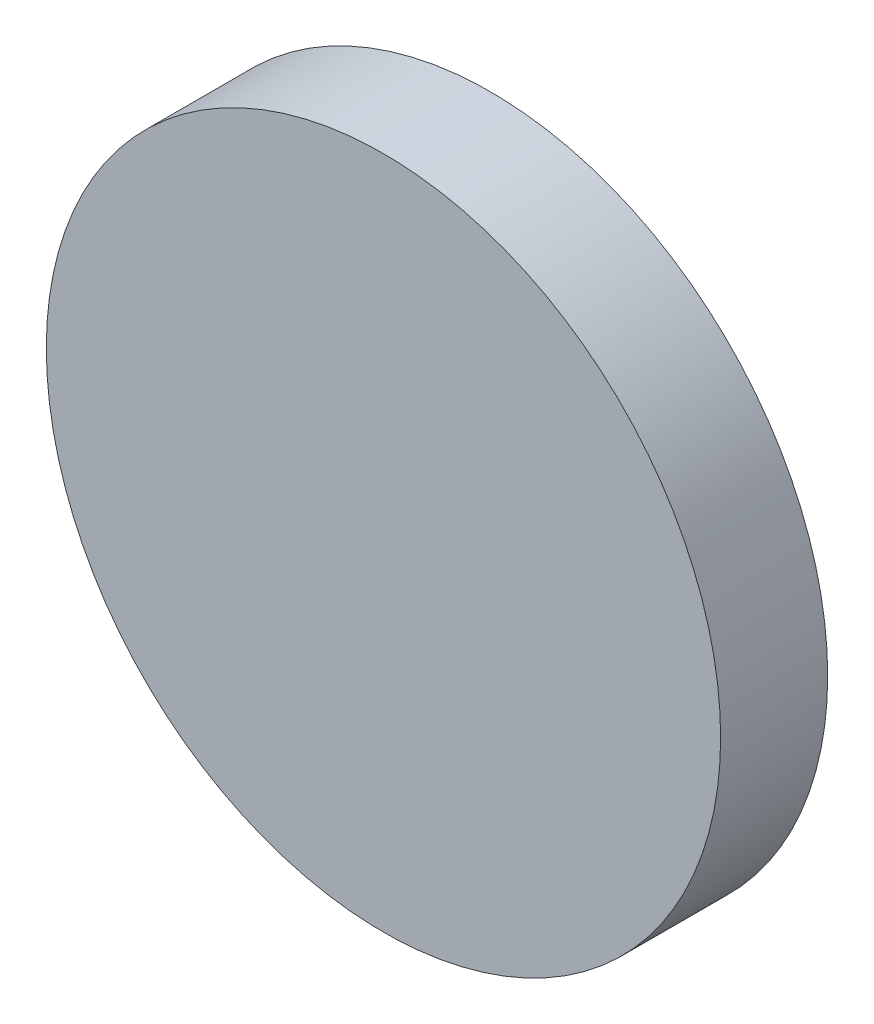
ISO-10303-21;
HEADER;
FILE_DESCRIPTION(('STEP AP214'),'2;1');
FILE_NAME('part.step','',(''),(''),'','','');
FILE_SCHEMA(('AUTOMOTIVE_DESIGN { 1 0 10303 214 1 1 1 1 }'));
ENDSEC;
DATA;
#1=APPLICATION_CONTEXT('core data for automotive mechanical design processes');
#2=APPLICATION_PROTOCOL_DEFINITION('international standard','automotive_design',2000,#1);
#3=PRODUCT_CONTEXT('',#1,'mechanical');
#4=PRODUCT('Part','Part','',(#3));
#5=PRODUCT_RELATED_PRODUCT_CATEGORY('part','',(#4));
#6=PRODUCT_DEFINITION_FORMATION('','',#4);
#7=PRODUCT_DEFINITION_CONTEXT('part definition',#1,'design');
#8=PRODUCT_DEFINITION('design','',#6,#7);
#9=PRODUCT_DEFINITION_SHAPE('','',#8);
#10=(LENGTH_UNIT() NAMED_UNIT(*) SI_UNIT(.MILLI.,.METRE.));
#11=(NAMED_UNIT(*) PLANE_ANGLE_UNIT() SI_UNIT($,.RADIAN.));
#12=(NAMED_UNIT(*) SI_UNIT($,.STERADIAN.) SOLID_ANGLE_UNIT());
#13=UNCERTAINTY_MEASURE_WITH_UNIT(LENGTH_MEASURE(1.E-05),#10,'distance_accuracy_value','');
#14=(GEOMETRIC_REPRESENTATION_CONTEXT(3) GLOBAL_UNCERTAINTY_ASSIGNED_CONTEXT((#13)) GLOBAL_UNIT_ASSIGNED_CONTEXT((#10,
#11,#12)) REPRESENTATION_CONTEXT('',''));
#15=CARTESIAN_POINT('',(0.,0.,0.));
#16=DIRECTION('',(0.,0.,1.));
#17=DIRECTION('',(1.,0.,0.));
#18=AXIS2_PLACEMENT_3D('',#15,#16,#17);
#19=CARTESIAN_POINT('',(0.,0.,1.5875));
#20=DIRECTION('',(0.,0.,-1.));
#21=DIRECTION('',(-1.,0.,0.));
#22=AXIS2_PLACEMENT_3D('',#19,#20,#21);
#23=CYLINDRICAL_SURFACE('',#22,5.);
#24=CARTESIAN_POINT('',(0.,0.,1.5875));
#25=DIRECTION('',(0.,0.,1.));
#26=DIRECTION('',(1.,0.,0.));
#27=AXIS2_PLACEMENT_3D('',#24,#25,#26);
#28=CIRCLE('',#27,5.);
#29=CARTESIAN_POINT('',(5.,0.,1.5875));
#30=VERTEX_POINT('',#29);
#31=EDGE_CURVE('E10',#30,#30,#28,.T.);
#32=ORIENTED_EDGE('',*,*,#31,.F.);
#33=EDGE_LOOP('',(#32));
#34=FACE_BOUND('',#33,.T.);
#35=CARTESIAN_POINT('',(0.,0.,0.));
#36=DIRECTION('',(0.,0.,1.));
#37=DIRECTION('',(1.,0.,0.));
#38=AXIS2_PLACEMENT_3D('',#35,#36,#37);
#39=CIRCLE('',#38,5.);
#40=CARTESIAN_POINT('',(5.,0.,0.));
#41=VERTEX_POINT('',#40);
#42=EDGE_CURVE('E36',#41,#41,#39,.T.);
#43=ORIENTED_EDGE('',*,*,#42,.T.);
#44=EDGE_LOOP('',(#43));
#45=FACE_BOUND('',#44,.T.);
#46=ADVANCED_FACE('F33',(#34,#45),#23,.T.);
#47=CARTESIAN_POINT('',(0.,0.,1.5875));
#48=DIRECTION('',(0.,0.,1.));
#49=DIRECTION('',(1.,0.,0.));
#50=AXIS2_PLACEMENT_3D('',#47,#48,#49);
#51=PLANE('',#50);
#52=ORIENTED_EDGE('',*,*,#31,.T.);
#53=EDGE_LOOP('',(#52));
#54=FACE_BOUND('',#53,.T.);
#55=ADVANCED_FACE('F48',(#54),#51,.T.);
#56=CARTESIAN_POINT('',(0.,0.,0.));
#57=DIRECTION('',(0.,0.,1.));
#58=DIRECTION('',(1.,0.,0.));
#59=AXIS2_PLACEMENT_3D('',#56,#57,#58);
#60=PLANE('',#59);
#61=ORIENTED_EDGE('',*,*,#42,.F.);
#62=EDGE_LOOP('',(#61));
#63=FACE_BOUND('',#62,.T.);
#64=ADVANCED_FACE('F46',(#63),#60,.F.);
#65=CLOSED_SHELL('',(#46,#55,#64));
#66=MANIFOLD_SOLID_BREP('B2',#65);
#67=ADVANCED_BREP_SHAPE_REPRESENTATION('',(#18,#66),#14);
#68=SHAPE_DEFINITION_REPRESENTATION(#9,#67);
ENDSEC;
END-ISO-10303-21;
